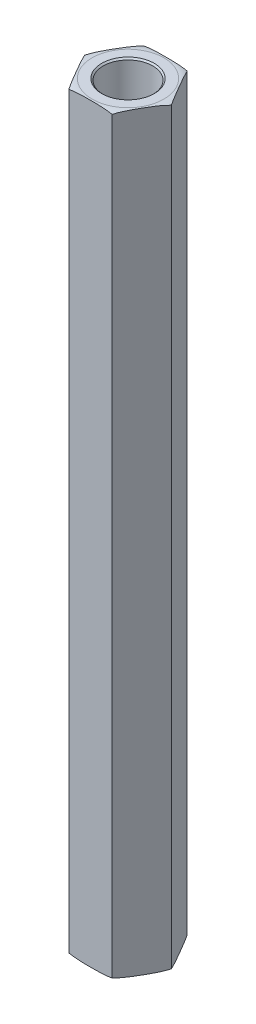
ISO-10303-21;
HEADER;
FILE_DESCRIPTION(('STEP AP214'),'2;1');
FILE_NAME('part.step','',(''),(''),'','','');
FILE_SCHEMA(('AUTOMOTIVE_DESIGN { 1 0 10303 214 1 1 1 1 }'));
ENDSEC;
DATA;
#1=APPLICATION_CONTEXT('core data for automotive mechanical design processes');
#2=APPLICATION_PROTOCOL_DEFINITION('international standard','automotive_design',2000,#1);
#3=PRODUCT_CONTEXT('',#1,'mechanical');
#4=PRODUCT('Part','Part','',(#3));
#5=PRODUCT_RELATED_PRODUCT_CATEGORY('part','',(#4));
#6=PRODUCT_DEFINITION_FORMATION('','',#4);
#7=PRODUCT_DEFINITION_CONTEXT('part definition',#1,'design');
#8=PRODUCT_DEFINITION('design','',#6,#7);
#9=PRODUCT_DEFINITION_SHAPE('','',#8);
#10=(LENGTH_UNIT() NAMED_UNIT(*) SI_UNIT(.MILLI.,.METRE.));
#11=(NAMED_UNIT(*) PLANE_ANGLE_UNIT() SI_UNIT($,.RADIAN.));
#12=(NAMED_UNIT(*) SI_UNIT($,.STERADIAN.) SOLID_ANGLE_UNIT());
#13=UNCERTAINTY_MEASURE_WITH_UNIT(LENGTH_MEASURE(1.E-05),#10,'distance_accuracy_value','');
#14=(GEOMETRIC_REPRESENTATION_CONTEXT(3) GLOBAL_UNCERTAINTY_ASSIGNED_CONTEXT((#13)) GLOBAL_UNIT_ASSIGNED_CONTEXT((#10,
#11,#12)) REPRESENTATION_CONTEXT('',''));
#15=CARTESIAN_POINT('',(0.,0.,0.));
#16=DIRECTION('',(0.,0.,1.));
#17=DIRECTION('',(1.,0.,0.));
#18=AXIS2_PLACEMENT_3D('',#15,#16,#17);
#19=CARTESIAN_POINT('',(0.,19.05,0.));
#20=DIRECTION('',(0.,1.,0.));
#21=DIRECTION('',(0.,0.,1.));
#22=AXIS2_PLACEMENT_3D('',#19,#20,#21);
#23=PLANE('',#22);
#24=CARTESIAN_POINT('',(0.,19.05,0.));
#25=DIRECTION('',(0.,1.,0.));
#26=DIRECTION('',(0.,0.,1.));
#27=AXIS2_PLACEMENT_3D('',#24,#25,#26);
#28=CIRCLE('',#27,2.0955);
#29=CARTESIAN_POINT('',(0.,19.05,2.0955));
#30=VERTEX_POINT('',#29);
#31=EDGE_CURVE('E303',#30,#30,#28,.T.);
#32=ORIENTED_EDGE('',*,*,#31,.T.);
#33=EDGE_LOOP('',(#32));
#34=FACE_BOUND('',#33,.T.);
#35=ADVANCED_FACE('F17',(#34),#23,.T.);
#36=CARTESIAN_POINT('',(0.,-19.05,0.));
#37=DIRECTION('',(0.,-1.,0.));
#38=DIRECTION('',(0.,0.,-1.));
#39=AXIS2_PLACEMENT_3D('',#36,#37,#38);
#40=PLANE('',#39);
#41=CARTESIAN_POINT('',(0.,-19.05,0.));
#42=DIRECTION('',(0.,-1.,0.));
#43=DIRECTION('',(0.,0.,-1.));
#44=AXIS2_PLACEMENT_3D('',#41,#42,#43);
#45=CIRCLE('',#44,2.0955);
#46=CARTESIAN_POINT('',(0.,-19.05,-2.0955));
#47=VERTEX_POINT('',#46);
#48=EDGE_CURVE('E313',#47,#47,#45,.T.);
#49=ORIENTED_EDGE('',*,*,#48,.T.);
#50=EDGE_LOOP('',(#49));
#51=FACE_BOUND('',#50,.T.);
#52=ADVANCED_FACE('F414',(#51),#40,.T.);
#53=CARTESIAN_POINT('',(0.,19.05,0.));
#54=DIRECTION('',(0.,1.,0.));
#55=DIRECTION('',(0.,0.,1.));
#56=AXIS2_PLACEMENT_3D('',#53,#54,#55);
#57=CYLINDRICAL_SURFACE('',#56,2.0955);
#58=CARTESIAN_POINT('',(0.,31.6230000000246,0.));
#59=DIRECTION('',(0.,1.,0.));
#60=DIRECTION('',(0.,0.,1.));
#61=AXIS2_PLACEMENT_3D('',#58,#59,#60);
#62=CIRCLE('',#61,2.09549999993897);
#63=CARTESIAN_POINT('',(0.,31.6230000000246,2.09549999993897));
#64=VERTEX_POINT('',#63);
#65=EDGE_CURVE('E315',#64,#64,#62,.T.);
#66=ORIENTED_EDGE('',*,*,#65,.T.);
#67=EDGE_LOOP('',(#66));
#68=FACE_BOUND('',#67,.T.);
#69=ORIENTED_EDGE('',*,*,#31,.F.);
#70=EDGE_LOOP('',(#69));
#71=FACE_BOUND('',#70,.T.);
#72=ADVANCED_FACE('F325',(#68,#71),#57,.F.);
#73=CARTESIAN_POINT('',(0.,-19.05,0.));
#74=DIRECTION('',(0.,-1.,0.));
#75=DIRECTION('',(0.,0.,-1.));
#76=AXIS2_PLACEMENT_3D('',#73,#74,#75);
#77=CYLINDRICAL_SURFACE('',#76,2.0955);
#78=ORIENTED_EDGE('',*,*,#48,.F.);
#79=EDGE_LOOP('',(#78));
#80=FACE_BOUND('',#79,.T.);
#81=CARTESIAN_POINT('',(0.,-31.6229999999678,0.));
#82=DIRECTION('',(0.,-1.,0.));
#83=DIRECTION('',(0.,0.,-1.));
#84=AXIS2_PLACEMENT_3D('',#81,#82,#83);
#85=CIRCLE('',#84,2.09549999999581);
#86=CARTESIAN_POINT('',(0.,-31.6229999999678,-2.09549999999581));
#87=VERTEX_POINT('',#86);
#88=EDGE_CURVE('E155',#87,#87,#85,.T.);
#89=ORIENTED_EDGE('',*,*,#88,.T.);
#90=EDGE_LOOP('',(#89));
#91=FACE_BOUND('',#90,.T.);
#92=ADVANCED_FACE('F330',(#80,#91),#77,.F.);
#93=CARTESIAN_POINT('',(0.,31.7499999999313,0.));
#94=DIRECTION('',(0.,1.,0.));
#95=DIRECTION('',(0.,0.,1.));
#96=AXIS2_PLACEMENT_3D('',#93,#94,#95);
#97=CONICAL_SURFACE('',#96,2.2224999998457,0.785398163173655);
#98=CARTESIAN_POINT('',(0.,31.7499999999882,0.));
#99=DIRECTION('',(0.,1.,0.));
#100=DIRECTION('',(0.,0.,1.));
#101=AXIS2_PLACEMENT_3D('',#98,#99,#100);
#102=CIRCLE('',#101,2.22249999990254);
#103=CARTESIAN_POINT('',(0.,31.7499999999882,2.22249999990254));
#104=VERTEX_POINT('',#103);
#105=EDGE_CURVE('E80',#104,#104,#102,.T.);
#106=ORIENTED_EDGE('',*,*,#105,.T.);
#107=EDGE_LOOP('',(#106));
#108=FACE_BOUND('',#107,.T.);
#109=ORIENTED_EDGE('',*,*,#65,.F.);
#110=EDGE_LOOP('',(#109));
#111=FACE_BOUND('',#110,.T.);
#112=ADVANCED_FACE('F328',(#108,#111),#97,.F.);
#113=CARTESIAN_POINT('',(-3.66617420935413,31.75,0.));
#114=DIRECTION('',(0.866025403784439,0.,-0.499999999999999));
#115=DIRECTION('',(-0.499999999999999,0.,-0.866025403784439));
#116=AXIS2_PLACEMENT_3D('',#113,#114,#115);
#117=PLANE('',#116);
#118=DIRECTION('',(0.,1.,0.));
#119=VECTOR('',#118,1.);
#120=CARTESIAN_POINT('',(-1.83308710467708,31.75,3.175));
#121=LINE('',#120,#119);
#122=CARTESIAN_POINT('',(-1.83308710467708,-31.623,3.17499999999999));
#123=VERTEX_POINT('',#122);
#124=CARTESIAN_POINT('',(-1.83308710467706,31.623,3.175));
#125=VERTEX_POINT('',#124);
#126=EDGE_CURVE('E76',#123,#125,#121,.T.);
#127=ORIENTED_EDGE('',*,*,#126,.T.);
#128=CARTESIAN_POINT('',(-3.66617420935412,31.623,0.));
#129=CARTESIAN_POINT('',(-3.62797961467395,31.6389014148997,0.0661549785605663));
#130=CARTESIAN_POINT('',(-3.58956810864157,31.6524886076105,0.132685658603884));
#131=CARTESIAN_POINT('',(-3.51249051795711,31.6758161979402,0.266187961794369));
#132=CARTESIAN_POINT('',(-3.47382473049846,31.6855604771397,0.333159070187402));
#133=CARTESIAN_POINT('',(-3.39641631867873,31.7019966530451,0.467234372392395));
#134=CARTESIAN_POINT('',(-3.35767399633312,31.7086945328669,0.534338043098199));
#135=CARTESIAN_POINT('',(-3.28009834620113,31.7197767572932,0.668703010556999));
#136=CARTESIAN_POINT('',(-3.24126499587771,31.724160450474,0.735964346345286));
#137=CARTESIAN_POINT('',(-3.16354065964314,31.7312403004263,0.870586845688118));
#138=CARTESIAN_POINT('',(-3.12464965374475,31.7339355237591,0.93794804386159));
#139=CARTESIAN_POINT('',(-3.04685144594592,31.7381531983713,1.07269849250697));
#140=CARTESIAN_POINT('',(-3.00794424351969,31.7396756080272,1.14008774388958));
#141=CARTESIAN_POINT('',(-2.93051517598872,31.741922705889,1.27419882283589));
#142=CARTESIAN_POINT('',(-2.89199336248934,31.7426552468181,1.34092056101652));
#143=CARTESIAN_POINT('',(-2.81494778346143,31.7435767302574,1.47436741839142));
#144=CARTESIAN_POINT('',(-2.77642401791438,31.7437656658949,1.54109253761777));
#145=CARTESIAN_POINT('',(-2.69935964431011,31.7436659966806,1.67457194815384));
#146=CARTESIAN_POINT('',(-2.6608190363182,31.7433771811766,1.74132623935042));
#147=CARTESIAN_POINT('',(-2.58373908085328,31.742221986219,1.87483263846081));
#148=CARTESIAN_POINT('',(-2.54519973341244,31.7413555970386,1.9415847463189));
#149=CARTESIAN_POINT('',(-2.46812969629769,31.7387861940656,2.07507396634286));
#150=CARTESIAN_POINT('',(-2.42959900625964,31.7370832271616,2.14181107913946));
#151=CARTESIAN_POINT('',(-2.35255651340907,31.7324387229726,2.27525259109841));
#152=CARTESIAN_POINT('',(-2.31404470975441,31.7294972471358,2.34195699171939));
#153=CARTESIAN_POINT('',(-2.25084206239943,31.7232174124749,2.45142718811108));
#154=CARTESIAN_POINT('',(-2.22613849337009,31.7203980110463,2.49421502479819));
#155=CARTESIAN_POINT('',(-2.17676945272227,31.7138696794304,2.57972471152114));
#156=CARTESIAN_POINT('',(-2.15210397034182,31.7101610809139,2.62244658019726));
#157=CARTESIAN_POINT('',(-2.10282753811695,31.7016802711497,2.70779586442647));
#158=CARTESIAN_POINT('',(-2.07821657107528,31.6969084657008,2.75042330976604));
#159=CARTESIAN_POINT('',(-2.02900094683549,31.6860987712516,2.83566727147558));
#160=CARTESIAN_POINT('',(-2.00439646085463,31.6800577313084,2.87828349128855));
#161=CARTESIAN_POINT('',(-1.95527325900933,31.6665138354161,2.96336737271506));
#162=CARTESIAN_POINT('',(-1.93075459617614,31.659010197803,3.0058349424758));
#163=CARTESIAN_POINT('',(-1.88182157373172,31.6423203507084,3.09058942351745));
#164=CARTESIAN_POINT('',(-1.8574074405327,31.6331314978033,3.1328759426409));
#165=CARTESIAN_POINT('',(-1.83308710467707,31.623,3.175));
#166=B_SPLINE_CURVE_WITH_KNOTS('',3,(#128,#129,#130,#131,#132,#133,#134,#135,#136,#137,#138,
#139,#140,#141,#142,#143,#144,#145,#146,#147,#148,#149,#150,#151,#152,#153,#154,#155,#156,#157,
#158,#159,#160,#161,#162,#163,#164,#165),.UNSPECIFIED.,.F.,.F.,(4,2,2,2,2,2,2,2,2,2,2,2,2,2,2,2,
2,2,4),(0.,0.233977307817944,0.467717675040698,0.700996973557508,0.93434190322976,
1.16781571967241,1.40129782179826,1.63243665809671,1.86357841666619,2.09482211846296,
2.32606971471497,2.557304351474,2.78852751694416,2.93698369265089,3.08538458004475,
3.23372892334585,3.38244598546613,3.53124274626084,3.68027493713584),.UNSPECIFIED.);
#167=CARTESIAN_POINT('',(-3.66617420935412,31.623,0.));
#168=VERTEX_POINT('',#167);
#169=EDGE_CURVE('E69',#168,#125,#166,.T.);
#170=ORIENTED_EDGE('',*,*,#169,.F.);
#171=DIRECTION('',(0.,1.,0.));
#172=VECTOR('',#171,1.);
#173=CARTESIAN_POINT('',(-3.66617420935413,31.75,0.));
#174=LINE('',#173,#172);
#175=CARTESIAN_POINT('',(-3.66617420935412,-31.623,0.));
#176=VERTEX_POINT('',#175);
#177=EDGE_CURVE('E73',#168,#176,#174,.F.);
#178=ORIENTED_EDGE('',*,*,#177,.T.);
#179=CARTESIAN_POINT('',(-1.83308710467708,-31.623,3.17499999999999));
#180=CARTESIAN_POINT('',(-1.87128169935725,-31.6389014148997,3.10884502143943));
#181=CARTESIAN_POINT('',(-1.90969320538963,-31.6524886076105,3.04231434139611));
#182=CARTESIAN_POINT('',(-1.98677079607409,-31.6758161979402,2.90881203820563));
#183=CARTESIAN_POINT('',(-2.02543658353273,-31.6855604771397,2.84184092981259));
#184=CARTESIAN_POINT('',(-2.10284499535247,-31.7019966530451,2.7077656276076));
#185=CARTESIAN_POINT('',(-2.14158731769807,-31.7086945328669,2.6406619569018));
#186=CARTESIAN_POINT('',(-2.21916296783006,-31.7197767572932,2.506296989443));
#187=CARTESIAN_POINT('',(-2.25799631815349,-31.724160450474,2.43903565365471));
#188=CARTESIAN_POINT('',(-2.33572065438805,-31.7312403004263,2.30441315431188));
#189=CARTESIAN_POINT('',(-2.37461166028644,-31.7339355237591,2.23705195613841));
#190=CARTESIAN_POINT('',(-2.45240986808527,-31.7381531983713,2.10230150749303));
#191=CARTESIAN_POINT('',(-2.49131707051151,-31.7396756080272,2.03491225611042));
#192=CARTESIAN_POINT('',(-2.56874613804247,-31.741922705889,1.90080117716411));
#193=CARTESIAN_POINT('',(-2.60726795154186,-31.7426552468181,1.83407943898348));
#194=CARTESIAN_POINT('',(-2.68431353056977,-31.7435767302574,1.70063258160857));
#195=CARTESIAN_POINT('',(-2.72283729611681,-31.7437656658949,1.63390746238222));
#196=CARTESIAN_POINT('',(-2.79990166972108,-31.7436659966806,1.50042805184616));
#197=CARTESIAN_POINT('',(-2.83844227771299,-31.7433771811766,1.43367376064957));
#198=CARTESIAN_POINT('',(-2.91552223317791,-31.742221986219,1.30016736153919));
#199=CARTESIAN_POINT('',(-2.95406158061876,-31.7413555970386,1.2334152536811));
#200=CARTESIAN_POINT('',(-3.0311316177335,-31.7387861940656,1.09992603365714));
#201=CARTESIAN_POINT('',(-3.06966230777156,-31.7370832271617,1.03318892086053));
#202=CARTESIAN_POINT('',(-3.14670480062212,-31.7324387229726,0.899747408901591));
#203=CARTESIAN_POINT('',(-3.18521660427678,-31.7294972471358,0.833043008280606));
#204=CARTESIAN_POINT('',(-3.24841925163176,-31.7232174124749,0.723572811888923));
#205=CARTESIAN_POINT('',(-3.27312282066111,-31.7203980110463,0.68078497520181));
#206=CARTESIAN_POINT('',(-3.32249186130892,-31.7138696794304,0.595275288478855));
#207=CARTESIAN_POINT('',(-3.34715734368937,-31.7101610809139,0.552553419802734));
#208=CARTESIAN_POINT('',(-3.39643377591424,-31.7016802711497,0.46720413557353));
#209=CARTESIAN_POINT('',(-3.42104474295591,-31.6969084657008,0.424576690233957));
#210=CARTESIAN_POINT('',(-3.4702603671957,-31.6860987712516,0.339332728524421));
#211=CARTESIAN_POINT('',(-3.49486485317656,-31.6800577313084,0.296716508711453));
#212=CARTESIAN_POINT('',(-3.54398805502186,-31.6665138354161,0.211632627284938));
#213=CARTESIAN_POINT('',(-3.56850671785505,-31.659010197803,0.169165057524199));
#214=CARTESIAN_POINT('',(-3.61743974029947,-31.6423203507084,0.0844105764825454));
#215=CARTESIAN_POINT('',(-3.64185387349849,-31.6331314978033,0.0421240573590993));
#216=CARTESIAN_POINT('',(-3.66617420935412,-31.623,0.));
#217=B_SPLINE_CURVE_WITH_KNOTS('',3,(#179,#180,#181,#182,#183,#184,#185,#186,#187,#188,#189,
#190,#191,#192,#193,#194,#195,#196,#197,#198,#199,#200,#201,#202,#203,#204,#205,#206,#207,#208,
#209,#210,#211,#212,#213,#214,#215,#216),.UNSPECIFIED.,.F.,.F.,(4,2,2,2,2,2,2,2,2,2,2,2,2,2,2,2,
2,2,4),(0.,0.233977307817944,0.467717675040698,0.700996973557507,0.934341903229758,
1.16781571967241,1.40129782179826,1.63243665809671,1.86357841666619,2.09482211846296,
2.32606971471497,2.557304351474,2.78852751694415,2.93698369265089,3.08538458004475,
3.23372892334585,3.38244598546612,3.53124274626083,3.68027493713583),.UNSPECIFIED.);
#218=EDGE_CURVE('E88',#123,#176,#217,.T.);
#219=ORIENTED_EDGE('',*,*,#218,.F.);
#220=EDGE_LOOP('',(#127,#170,#178,#219));
#221=FACE_BOUND('',#220,.T.);
#222=ADVANCED_FACE('F71',(#221),#117,.F.);
#223=CARTESIAN_POINT('',(0.,-31.7499999998745,0.));
#224=DIRECTION('',(0.,-1.,0.));
#225=DIRECTION('',(0.,0.,-1.));
#226=AXIS2_PLACEMENT_3D('',#223,#224,#225);
#227=CONICAL_SURFACE('',#226,2.22249999990254,0.785398163397448);
#228=ORIENTED_EDGE('',*,*,#88,.F.);
#229=EDGE_LOOP('',(#228));
#230=FACE_BOUND('',#229,.T.);
#231=CARTESIAN_POINT('',(0.,-31.7499999999882,0.));
#232=DIRECTION('',(0.,-1.,0.));
#233=DIRECTION('',(0.,0.,-1.));
#234=AXIS2_PLACEMENT_3D('',#231,#232,#233);
#235=CIRCLE('',#234,2.22250000001623);
#236=CARTESIAN_POINT('',(0.,-31.7499999999882,-2.22250000001623));
#237=VERTEX_POINT('',#236);
#238=EDGE_CURVE('E279',#237,#237,#235,.F.);
#239=ORIENTED_EDGE('',*,*,#238,.F.);
#240=EDGE_LOOP('',(#239));
#241=FACE_BOUND('',#240,.T.);
#242=ADVANCED_FACE('F337',(#230,#241),#227,.F.);
#243=CARTESIAN_POINT('',(-1.83308710467707,31.75,-3.175));
#244=DIRECTION('',(0.,-1.,0.));
#245=DIRECTION('',(0.,0.,-1.));
#246=AXIS2_PLACEMENT_3D('',#243,#244,#245);
#247=PLANE('',#246);
#248=CARTESIAN_POINT('',(0.,31.75,0.));
#249=DIRECTION('',(0.,-1.,0.));
#250=DIRECTION('',(0.,0.,1.));
#251=AXIS2_PLACEMENT_3D('',#248,#249,#250);
#252=CIRCLE('',#251,3.03117420935412);
#253=CARTESIAN_POINT('',(0.,31.75,3.03117420935412));
#254=VERTEX_POINT('',#253);
#255=CARTESIAN_POINT('',(0.,31.75,-3.03117420935412));
#256=VERTEX_POINT('',#255);
#257=EDGE_CURVE('E79',#254,#256,#252,.T.);
#258=ORIENTED_EDGE('',*,*,#257,.F.);
#259=CARTESIAN_POINT('',(0.,31.75,0.));
#260=DIRECTION('',(0.,-1.,0.));
#261=DIRECTION('',(0.,0.,-1.));
#262=AXIS2_PLACEMENT_3D('',#259,#260,#261);
#263=CIRCLE('',#262,3.03117420935412);
#264=EDGE_CURVE('E140',#256,#254,#263,.T.);
#265=ORIENTED_EDGE('',*,*,#264,.F.);
#266=EDGE_LOOP('',(#258,#265));
#267=FACE_BOUND('',#266,.T.);
#268=ORIENTED_EDGE('',*,*,#105,.F.);
#269=EDGE_LOOP('',(#268));
#270=FACE_BOUND('',#269,.T.);
#271=ADVANCED_FACE('F116',(#267,#270),#247,.F.);
#272=CARTESIAN_POINT('',(-1.83308710467707,31.75,-3.175));
#273=DIRECTION('',(0.866025403784439,0.,0.5));
#274=DIRECTION('',(0.5,0.,-0.866025403784439));
#275=AXIS2_PLACEMENT_3D('',#272,#273,#274);
#276=PLANE('',#275);
#277=ORIENTED_EDGE('',*,*,#177,.F.);
#278=CARTESIAN_POINT('',(-1.83308710467706,31.623,-3.17500000000001));
#279=CARTESIAN_POINT('',(-1.87128169935723,31.6389014148997,-3.10884502143945));
#280=CARTESIAN_POINT('',(-1.90969320538961,31.6524886076105,-3.04231434139614));
#281=CARTESIAN_POINT('',(-1.98677079607407,31.6758161979402,-2.90881203820566));
#282=CARTESIAN_POINT('',(-2.02543658353271,31.6855604771397,-2.84184092981263));
#283=CARTESIAN_POINT('',(-2.10284499535244,31.7019966530451,-2.70776562760764));
#284=CARTESIAN_POINT('',(-2.14158731769805,31.7086945328669,-2.64066195690184));
#285=CARTESIAN_POINT('',(-2.21916296783004,31.7197767572932,-2.50629698944304));
#286=CARTESIAN_POINT('',(-2.25799631815346,31.7241604504739,-2.43903565365476));
#287=CARTESIAN_POINT('',(-2.33572065438802,31.7312403004263,-2.30441315431193));
#288=CARTESIAN_POINT('',(-2.37461166028641,31.7339355237591,-2.23705195613846));
#289=CARTESIAN_POINT('',(-2.45240986808524,31.7381531983713,-2.10230150749309));
#290=CARTESIAN_POINT('',(-2.49131707051148,31.7396756080272,-2.03491225611048));
#291=CARTESIAN_POINT('',(-2.56874613804244,31.741922705889,-1.90080117716417));
#292=CARTESIAN_POINT('',(-2.60726795154182,31.7426552468181,-1.83407943898354));
#293=CARTESIAN_POINT('',(-2.68431353056973,31.7435767302574,-1.70063258160864));
#294=CARTESIAN_POINT('',(-2.72283729611677,31.7437656658949,-1.6339074623823));
#295=CARTESIAN_POINT('',(-2.79990166972104,31.7436659966806,-1.50042805184624));
#296=CARTESIAN_POINT('',(-2.83844227771295,31.7433771811766,-1.43367376064965));
#297=CARTESIAN_POINT('',(-2.91552223317786,31.742221986219,-1.30016736153927));
#298=CARTESIAN_POINT('',(-2.95406158061871,31.7413555970386,-1.23341525368118));
#299=CARTESIAN_POINT('',(-3.03113161773345,31.7387861940656,-1.09992603365722));
#300=CARTESIAN_POINT('',(-3.06966230777151,31.7370832271617,-1.03318892086062));
#301=CARTESIAN_POINT('',(-3.14670480062207,31.7324387229726,-0.899747408901685));
#302=CARTESIAN_POINT('',(-3.18521660427673,31.7294972471358,-0.833043008280701));
#303=CARTESIAN_POINT('',(-3.24841925163171,31.7232174124749,-0.723572811889015));
#304=CARTESIAN_POINT('',(-3.27312282066106,31.7203980110463,-0.680784975201897));
#305=CARTESIAN_POINT('',(-3.32249186130888,31.7138696794304,-0.595275288478931));
#306=CARTESIAN_POINT('',(-3.34715734368933,31.7101610809139,-0.552553419802804));
#307=CARTESIAN_POINT('',(-3.39643377591421,31.7016802711497,-0.467204135573589));
#308=CARTESIAN_POINT('',(-3.42104474295588,31.6969084657008,-0.424576690234012));
#309=CARTESIAN_POINT('',(-3.47026036719568,31.6860987712516,-0.339332728524465));
#310=CARTESIAN_POINT('',(-3.49486485317654,31.6800577313084,-0.296716508711491));
#311=CARTESIAN_POINT('',(-3.54398805502185,31.6665138354161,-0.211632627284964));
#312=CARTESIAN_POINT('',(-3.56850671785504,31.659010197803,-0.169165057524221));
#313=CARTESIAN_POINT('',(-3.61743974029947,31.6423203507084,-0.0844105764825552));
#314=CARTESIAN_POINT('',(-3.64185387349849,31.6331314978033,-0.0421240573591034));
#315=CARTESIAN_POINT('',(-3.66617420935413,31.623,0.));
#316=B_SPLINE_CURVE_WITH_KNOTS('',3,(#278,#279,#280,#281,#282,#283,#284,#285,#286,#287,#288,
#289,#290,#291,#292,#293,#294,#295,#296,#297,#298,#299,#300,#301,#302,#303,#304,#305,#306,#307,
#308,#309,#310,#311,#312,#313,#314,#315),.UNSPECIFIED.,.F.,.F.,(4,2,2,2,2,2,2,2,2,2,2,2,2,2,2,2,
2,2,4),(0.,0.233977307817937,0.467717675040683,0.700996973557484,0.934341903229729,
1.16781571967237,1.40129782179821,1.63243665809666,1.86357841666613,2.0948221184629,
2.3260697147149,2.55730435147392,2.78852751694407,2.93698369265082,3.0853845800447,
3.23372892334582,3.38244598546612,3.53124274626084,3.68027493713587),.UNSPECIFIED.);
#317=CARTESIAN_POINT('',(-1.83308710467705,31.623,-3.17500000000001));
#318=VERTEX_POINT('',#317);
#319=EDGE_CURVE('E85',#318,#168,#316,.T.);
#320=ORIENTED_EDGE('',*,*,#319,.F.);
#321=DIRECTION('',(0.,1.,0.));
#322=VECTOR('',#321,1.);
#323=CARTESIAN_POINT('',(-1.83308710467704,31.75,-3.175));
#324=LINE('',#323,#322);
#325=CARTESIAN_POINT('',(-1.83308710467708,-31.623,-3.175));
#326=VERTEX_POINT('',#325);
#327=EDGE_CURVE('E178',#318,#326,#324,.F.);
#328=ORIENTED_EDGE('',*,*,#327,.T.);
#329=CARTESIAN_POINT('',(-3.66617420935412,-31.623,0.));
#330=CARTESIAN_POINT('',(-3.62797961467395,-31.6389014148997,-0.0661549785605667));
#331=CARTESIAN_POINT('',(-3.58956810864157,-31.6524886076105,-0.132685658603884));
#332=CARTESIAN_POINT('',(-3.51249051795711,-31.6758161979402,-0.266187961794367));
#333=CARTESIAN_POINT('',(-3.47382473049847,-31.6855604771397,-0.333159070187399));
#334=CARTESIAN_POINT('',(-3.39641631867874,-31.7019966530451,-0.467234372392391));
#335=CARTESIAN_POINT('',(-3.35767399633313,-31.7086945328669,-0.534338043098195));
#336=CARTESIAN_POINT('',(-3.28009834620114,-31.7197767572932,-0.668703010556993));
#337=CARTESIAN_POINT('',(-3.24126499587771,-31.724160450474,-0.73596434634528));
#338=CARTESIAN_POINT('',(-3.16354065964315,-31.7312403004263,-0.870586845688111));
#339=CARTESIAN_POINT('',(-3.12464965374476,-31.7339355237591,-0.937948043861582));
#340=CARTESIAN_POINT('',(-3.04685144594593,-31.7381531983713,-1.07269849250696));
#341=CARTESIAN_POINT('',(-3.00794424351969,-31.7396756080272,-1.14008774388957));
#342=CARTESIAN_POINT('',(-2.93051517598873,-31.741922705889,-1.27419882283587));
#343=CARTESIAN_POINT('',(-2.89199336248934,-31.7426552468181,-1.34092056101651));
#344=CARTESIAN_POINT('',(-2.81494778346144,-31.7435767302574,-1.47436741839141));
#345=CARTESIAN_POINT('',(-2.77642401791439,-31.7437656658949,-1.54109253761776));
#346=CARTESIAN_POINT('',(-2.69935964431012,-31.7436659966806,-1.67457194815382));
#347=CARTESIAN_POINT('',(-2.66081903631821,-31.7433771811766,-1.74132623935041));
#348=CARTESIAN_POINT('',(-2.5837390808533,-31.742221986219,-1.87483263846079));
#349=CARTESIAN_POINT('',(-2.54519973341245,-31.7413555970386,-1.94158474631888));
#350=CARTESIAN_POINT('',(-2.4681296962977,-31.7387861940656,-2.07507396634284));
#351=CARTESIAN_POINT('',(-2.42959900625965,-31.7370832271617,-2.14181107913944));
#352=CARTESIAN_POINT('',(-2.35255651340908,-31.7324387229726,-2.27525259109839));
#353=CARTESIAN_POINT('',(-2.31404470975442,-31.7294972471358,-2.34195699171937));
#354=CARTESIAN_POINT('',(-2.25084206239944,-31.7232174124749,-2.45142718811105));
#355=CARTESIAN_POINT('',(-2.2261384933701,-31.7203980110463,-2.49421502479817));
#356=CARTESIAN_POINT('',(-2.17676945272228,-31.7138696794304,-2.57972471152112));
#357=CARTESIAN_POINT('',(-2.15210397034184,-31.7101610809139,-2.62244658019725));
#358=CARTESIAN_POINT('',(-2.10282753811696,-31.7016802711497,-2.70779586442645));
#359=CARTESIAN_POINT('',(-2.07821657107529,-31.6969084657008,-2.75042330976602));
#360=CARTESIAN_POINT('',(-2.0290009468355,-31.6860987712516,-2.83566727147556));
#361=CARTESIAN_POINT('',(-2.00439646085464,-31.6800577313084,-2.87828349128853));
#362=CARTESIAN_POINT('',(-1.95527325900934,-31.6665138354161,-2.96336737271505));
#363=CARTESIAN_POINT('',(-1.93075459617615,-31.659010197803,-3.00583494247579));
#364=CARTESIAN_POINT('',(-1.88182157373172,-31.6423203507084,-3.09058942351744));
#365=CARTESIAN_POINT('',(-1.85740744053271,-31.6331314978033,-3.13287594264089));
#366=CARTESIAN_POINT('',(-1.83308710467707,-31.623,-3.17499999999999));
#367=B_SPLINE_CURVE_WITH_KNOTS('',3,(#329,#330,#331,#332,#333,#334,#335,#336,#337,#338,#339,
#340,#341,#342,#343,#344,#345,#346,#347,#348,#349,#350,#351,#352,#353,#354,#355,#356,#357,#358,
#359,#360,#361,#362,#363,#364,#365,#366),.UNSPECIFIED.,.F.,.F.,(4,2,2,2,2,2,2,2,2,2,2,2,2,2,2,2,
2,2,4),(0.,0.233977307817942,0.467717675040695,0.700996973557501,0.934341903229752,
1.1678157196724,1.40129782179825,1.6324366580967,1.86357841666617,2.09482211846295,
2.32606971471495,2.55730435147398,2.78852751694413,2.93698369265087,3.08538458004473,
3.23372892334584,3.38244598546612,3.53124274626082,3.68027493713583),.UNSPECIFIED.);
#368=EDGE_CURVE('E87',#176,#326,#367,.T.);
#369=ORIENTED_EDGE('',*,*,#368,.F.);
#370=EDGE_LOOP('',(#277,#320,#328,#369));
#371=FACE_BOUND('',#370,.T.);
#372=ADVANCED_FACE('F83',(#371),#276,.F.);
#373=CARTESIAN_POINT('',(-1.83308710467707,31.75,3.175));
#374=DIRECTION('',(0.,0.,-1.));
#375=DIRECTION('',(-1.,0.,0.));
#376=AXIS2_PLACEMENT_3D('',#373,#374,#375);
#377=PLANE('',#376);
#378=DIRECTION('',(0.,1.,0.));
#379=VECTOR('',#378,1.);
#380=CARTESIAN_POINT('',(1.83308710467706,31.75,3.17499999999999));
#381=LINE('',#380,#379);
#382=CARTESIAN_POINT('',(1.83308710467706,-31.623,3.17499999999999));
#383=VERTEX_POINT('',#382);
#384=CARTESIAN_POINT('',(1.83308710467706,31.623,3.17499999999999));
#385=VERTEX_POINT('',#384);
#386=EDGE_CURVE('E180',#383,#385,#381,.T.);
#387=ORIENTED_EDGE('',*,*,#386,.T.);
#388=CARTESIAN_POINT('',(-1.83308710467706,31.623,3.175));
#389=CARTESIAN_POINT('',(-1.73237579828683,31.6439400141518,3.175));
#390=CARTESIAN_POINT('',(-1.63096506893486,31.6608853495327,3.175));
#391=CARTESIAN_POINT('',(-1.42767146651469,31.6884971643984,3.175));
#392=CARTESIAN_POINT('',(-1.32579191427254,31.6991875658753,3.175));
#393=CARTESIAN_POINT('',(-1.12177634709138,31.7161280408079,3.175));
#394=CARTESIAN_POINT('',(-1.0196405664338,31.7223812707189,3.175));
#395=CARTESIAN_POINT('',(-0.815663681397377,31.7319028064183,3.175));
#396=CARTESIAN_POINT('',(-0.713823115514574,31.7351834044999,3.175));
#397=CARTESIAN_POINT('',(-0.510018485441651,31.7399454848703,3.175));
#398=CARTESIAN_POINT('',(-0.408054390577977,31.7414254100882,3.175));
#399=CARTESIAN_POINT('',(-0.204060200337871,31.7433146818379,3.175));
#400=CARTESIAN_POINT('',(-0.102030100168935,31.7437234241492,3.17499999999999));
#401=CARTESIAN_POINT('',(0.102030100168936,31.7437234241492,3.17499999999999));
#402=CARTESIAN_POINT('',(0.204060200337871,31.7433146818379,3.17499999999999));
#403=CARTESIAN_POINT('',(0.408054390577978,31.7414254100882,3.175));
#404=CARTESIAN_POINT('',(0.510018485441653,31.7399454848703,3.17499999999999));
#405=CARTESIAN_POINT('',(0.713823115514575,31.7351834044999,3.17499999999999));
#406=CARTESIAN_POINT('',(0.815663681397378,31.7319028064183,3.17499999999999));
#407=CARTESIAN_POINT('',(1.0196405664338,31.7223812707189,3.17499999999999));
#408=CARTESIAN_POINT('',(1.12177634709138,31.7161280408079,3.17499999999999));
#409=CARTESIAN_POINT('',(1.32579191427254,31.6991875658753,3.17499999999999));
#410=CARTESIAN_POINT('',(1.42767146651469,31.6884971643984,3.17499999999999));
#411=CARTESIAN_POINT('',(1.63096506893486,31.6608853495327,3.17499999999999));
#412=CARTESIAN_POINT('',(1.73237579828684,31.6439400141518,3.17499999999999));
#413=CARTESIAN_POINT('',(1.83308710467706,31.623,3.17499999999999));
#414=B_SPLINE_CURVE_WITH_KNOTS('',3,(#388,#389,#390,#391,#392,#393,#394,#395,#396,#397,#398,
#399,#400,#401,#402,#403,#404,#405,#406,#407,#408,#409,#410,#411,#412,#413),.UNSPECIFIED.,.F.,
.F.,(4,2,2,2,2,2,2,2,2,2,2,2,4),(0.,0.308333242342808,0.615479423308236,0.92240689113001,
1.2280592962085,1.53397581645216,1.84006485747889,2.14615389850562,2.45207041874928,
2.75772282382777,3.06465029164955,3.37179647261497,3.68012971495778),.UNSPECIFIED.);
#415=EDGE_CURVE('E274',#125,#385,#414,.T.);
#416=ORIENTED_EDGE('',*,*,#415,.F.);
#417=ORIENTED_EDGE('',*,*,#126,.F.);
#418=CARTESIAN_POINT('',(1.83308710467706,-31.623,3.17499999999999));
#419=CARTESIAN_POINT('',(1.73237579828684,-31.6439400141518,3.17499999999999));
#420=CARTESIAN_POINT('',(1.63096506893486,-31.6608853495327,3.17499999999999));
#421=CARTESIAN_POINT('',(1.42767146651469,-31.6884971643984,3.17499999999999));
#422=CARTESIAN_POINT('',(1.32579191427254,-31.6991875658753,3.17499999999999));
#423=CARTESIAN_POINT('',(1.12177634709138,-31.7161280408079,3.17499999999999));
#424=CARTESIAN_POINT('',(1.0196405664338,-31.7223812707189,3.17499999999999));
#425=CARTESIAN_POINT('',(0.815663681397379,-31.7319028064183,3.17499999999999));
#426=CARTESIAN_POINT('',(0.713823115514576,-31.7351834044999,3.17499999999999));
#427=CARTESIAN_POINT('',(0.510018485441653,-31.7399454848703,3.17499999999999));
#428=CARTESIAN_POINT('',(0.408054390577978,-31.7414254100882,3.175));
#429=CARTESIAN_POINT('',(0.204060200337871,-31.7433146818379,3.17499999999999));
#430=CARTESIAN_POINT('',(0.102030100168936,-31.7437234241492,3.17499999999999));
#431=CARTESIAN_POINT('',(-0.102030100168936,-31.7437234241492,3.17499999999999));
#432=CARTESIAN_POINT('',(-0.204060200337873,-31.7433146818379,3.175));
#433=CARTESIAN_POINT('',(-0.408054390577981,-31.7414254100882,3.175));
#434=CARTESIAN_POINT('',(-0.510018485441656,-31.7399454848703,3.175));
#435=CARTESIAN_POINT('',(-0.71382311551458,-31.7351834044999,3.175));
#436=CARTESIAN_POINT('',(-0.815663681397384,-31.7319028064183,3.175));
#437=CARTESIAN_POINT('',(-1.01964056643381,-31.7223812707189,3.175));
#438=CARTESIAN_POINT('',(-1.12177634709139,-31.7161280408079,3.175));
#439=CARTESIAN_POINT('',(-1.32579191427255,-31.6991875658753,3.175));
#440=CARTESIAN_POINT('',(-1.4276714665147,-31.6884971643984,3.175));
#441=CARTESIAN_POINT('',(-1.63096506893487,-31.6608853495327,3.175));
#442=CARTESIAN_POINT('',(-1.73237579828685,-31.6439400141518,3.175));
#443=CARTESIAN_POINT('',(-1.83308710467708,-31.623,3.175));
#444=B_SPLINE_CURVE_WITH_KNOTS('',3,(#418,#419,#420,#421,#422,#423,#424,#425,#426,#427,#428,
#429,#430,#431,#432,#433,#434,#435,#436,#437,#438,#439,#440,#441,#442,#443),.UNSPECIFIED.,.F.,
.F.,(4,2,2,2,2,2,2,2,2,2,2,2,4),(0.,0.308333242342809,0.615479423308237,0.922406891130012,
1.2280592962085,1.53397581645216,1.84006485747889,2.14615389850562,2.45207041874929,
2.75772282382778,3.06465029164956,3.37179647261499,3.6801297149578),.UNSPECIFIED.);
#445=EDGE_CURVE('E251',#383,#123,#444,.T.);
#446=ORIENTED_EDGE('',*,*,#445,.F.);
#447=EDGE_LOOP('',(#387,#416,#417,#446));
#448=FACE_BOUND('',#447,.T.);
#449=ADVANCED_FACE('F204',(#448),#377,.F.);
#450=CARTESIAN_POINT('',(-1.83308710467707,-31.75,-3.175));
#451=DIRECTION('',(0.,-1.,0.));
#452=DIRECTION('',(0.,0.,-1.));
#453=AXIS2_PLACEMENT_3D('',#450,#451,#452);
#454=PLANE('',#453);
#455=CARTESIAN_POINT('',(0.,-31.75,0.));
#456=DIRECTION('',(0.,1.,0.));
#457=DIRECTION('',(0.,0.,1.));
#458=AXIS2_PLACEMENT_3D('',#455,#456,#457);
#459=CIRCLE('',#458,3.03117420935412);
#460=CARTESIAN_POINT('',(0.,-31.75,3.03117420935412));
#461=VERTEX_POINT('',#460);
#462=CARTESIAN_POINT('',(0.,-31.75,-3.03117420935412));
#463=VERTEX_POINT('',#462);
#464=EDGE_CURVE('E190',#461,#463,#459,.T.);
#465=ORIENTED_EDGE('',*,*,#464,.F.);
#466=CARTESIAN_POINT('',(0.,-31.75,0.));
#467=DIRECTION('',(0.,1.,0.));
#468=DIRECTION('',(0.,0.,-1.));
#469=AXIS2_PLACEMENT_3D('',#466,#467,#468);
#470=CIRCLE('',#469,3.03117420935412);
#471=EDGE_CURVE('E183',#461,#463,#470,.F.);
#472=ORIENTED_EDGE('',*,*,#471,.T.);
#473=EDGE_LOOP('',(#465,#472));
#474=FACE_BOUND('',#473,.T.);
#475=ORIENTED_EDGE('',*,*,#238,.T.);
#476=EDGE_LOOP('',(#475));
#477=FACE_BOUND('',#476,.T.);
#478=ADVANCED_FACE('F195',(#474,#477),#454,.T.);
#479=CARTESIAN_POINT('',(1.83308710467706,31.75,3.17499999999999));
#480=DIRECTION('',(-0.866025403784439,0.,-0.5));
#481=DIRECTION('',(-0.5,0.,0.866025403784439));
#482=AXIS2_PLACEMENT_3D('',#479,#480,#481);
#483=PLANE('',#482);
#484=DIRECTION('',(0.,1.,0.));
#485=VECTOR('',#484,1.);
#486=CARTESIAN_POINT('',(3.66617420935412,31.75,0.));
#487=LINE('',#486,#485);
#488=CARTESIAN_POINT('',(3.66617420935412,-31.623,0.));
#489=VERTEX_POINT('',#488);
#490=CARTESIAN_POINT('',(3.66617420935412,31.623,0.));
#491=VERTEX_POINT('',#490);
#492=EDGE_CURVE('E236',#489,#491,#487,.T.);
#493=ORIENTED_EDGE('',*,*,#492,.T.);
#494=CARTESIAN_POINT('',(1.83308710467706,31.623,3.17499999999999));
#495=CARTESIAN_POINT('',(1.87128169935724,31.6389014148997,3.10884502143943));
#496=CARTESIAN_POINT('',(1.90969320538961,31.6524886076105,3.04231434139612));
#497=CARTESIAN_POINT('',(1.98677079607408,31.6758161979402,2.90881203820563));
#498=CARTESIAN_POINT('',(2.02543658353272,31.6855604771397,2.8418409298126));
#499=CARTESIAN_POINT('',(2.10284499535245,31.7019966530451,2.70776562760761));
#500=CARTESIAN_POINT('',(2.14158731769806,31.7086945328669,2.6406619569018));
#501=CARTESIAN_POINT('',(2.21916296783005,31.7197767572932,2.506296989443));
#502=CARTESIAN_POINT('',(2.25799631815348,31.724160450474,2.43903565365472));
#503=CARTESIAN_POINT('',(2.33572065438804,31.7312403004263,2.30441315431189));
#504=CARTESIAN_POINT('',(2.37461166028643,31.7339355237591,2.23705195613841));
#505=CARTESIAN_POINT('',(2.45240986808526,31.7381531983713,2.10230150749304));
#506=CARTESIAN_POINT('',(2.4913170705115,31.7396756080272,2.03491225611043));
#507=CARTESIAN_POINT('',(2.56874613804246,31.741922705889,1.90080117716412));
#508=CARTESIAN_POINT('',(2.60726795154185,31.7426552468181,1.83407943898349));
#509=CARTESIAN_POINT('',(2.68431353056976,31.7435767302574,1.70063258160858));
#510=CARTESIAN_POINT('',(2.7228372961168,31.7437656658949,1.63390746238223));
#511=CARTESIAN_POINT('',(2.79990166972107,31.7436659966806,1.50042805184617));
#512=CARTESIAN_POINT('',(2.83844227771298,31.7433771811766,1.43367376064958));
#513=CARTESIAN_POINT('',(2.9155222331779,31.742221986219,1.3001673615392));
#514=CARTESIAN_POINT('',(2.95406158061874,31.7413555970386,1.23341525368111));
#515=CARTESIAN_POINT('',(3.03113161773349,31.7387861940656,1.09992603365715));
#516=CARTESIAN_POINT('',(3.06966230777154,31.7370832271617,1.03318892086055));
#517=CARTESIAN_POINT('',(3.14670480062211,31.7324387229726,0.899747408901602));
#518=CARTESIAN_POINT('',(3.18521660427677,31.7294972471358,0.833043008280616));
#519=CARTESIAN_POINT('',(3.24841925163175,31.7232174124749,0.723572811888934));
#520=CARTESIAN_POINT('',(3.2731228206611,31.7203980110463,0.68078497520182));
#521=CARTESIAN_POINT('',(3.32249186130891,31.7138696794304,0.595275288478865));
#522=CARTESIAN_POINT('',(3.34715734368936,31.7101610809139,0.552553419802743));
#523=CARTESIAN_POINT('',(3.39643377591423,31.7016802711497,0.467204135573538));
#524=CARTESIAN_POINT('',(3.4210447429559,31.6969084657008,0.424576690233965));
#525=CARTESIAN_POINT('',(3.47026036719569,31.6860987712516,0.339332728524429));
#526=CARTESIAN_POINT('',(3.49486485317655,31.6800577313084,0.29671650871146));
#527=CARTESIAN_POINT('',(3.54398805502185,31.6665138354161,0.211632627284944));
#528=CARTESIAN_POINT('',(3.56850671785504,31.659010197803,0.169165057524205));
#529=CARTESIAN_POINT('',(3.61743974029947,31.6423203507084,0.0844105764825504));
#530=CARTESIAN_POINT('',(3.64185387349848,31.6331314978033,0.0421240573591037));
#531=CARTESIAN_POINT('',(3.66617420935412,31.623,0.));
#532=B_SPLINE_CURVE_WITH_KNOTS('',3,(#494,#495,#496,#497,#498,#499,#500,#501,#502,#503,#504,
#505,#506,#507,#508,#509,#510,#511,#512,#513,#514,#515,#516,#517,#518,#519,#520,#521,#522,#523,
#524,#525,#526,#527,#528,#529,#530,#531),.UNSPECIFIED.,.F.,.F.,(4,2,2,2,2,2,2,2,2,2,2,2,2,2,2,2,
2,2,4),(0.,0.233977307817943,0.467717675040697,0.700996973557505,0.934341903229756,
1.1678157196724,1.40129782179825,1.63243665809671,1.86357841666618,2.09482211846296,
2.32606971471496,2.55730435147399,2.78852751694415,2.93698369265089,3.08538458004475,
3.23372892334585,3.38244598546612,3.53124274626083,3.68027493713584),.UNSPECIFIED.);
#533=EDGE_CURVE('E269',#385,#491,#532,.T.);
#534=ORIENTED_EDGE('',*,*,#533,.F.);
#535=ORIENTED_EDGE('',*,*,#386,.F.);
#536=CARTESIAN_POINT('',(3.66617420935412,-31.623,0.));
#537=CARTESIAN_POINT('',(3.62797961467394,-31.6389014148997,0.0661549785605657));
#538=CARTESIAN_POINT('',(3.58956810864156,-31.6524886076105,0.132685658603883));
#539=CARTESIAN_POINT('',(3.5124905179571,-31.6758161979402,0.266187961794369));
#540=CARTESIAN_POINT('',(3.47382473049846,-31.6855604771397,0.333159070187401));
#541=CARTESIAN_POINT('',(3.39641631867873,-31.7019966530451,0.467234372392394));
#542=CARTESIAN_POINT('',(3.35767399633312,-31.7086945328669,0.534338043098198));
#543=CARTESIAN_POINT('',(3.28009834620112,-31.7197767572932,0.668703010556997));
#544=CARTESIAN_POINT('',(3.2412649958777,-31.724160450474,0.735964346345285));
#545=CARTESIAN_POINT('',(3.16354065964314,-31.7312403004263,0.870586845688117));
#546=CARTESIAN_POINT('',(3.12464965374475,-31.7339355237591,0.93794804386159));
#547=CARTESIAN_POINT('',(3.04685144594592,-31.7381531983713,1.07269849250697));
#548=CARTESIAN_POINT('',(3.00794424351968,-31.7396756080272,1.14008774388958));
#549=CARTESIAN_POINT('',(2.93051517598872,-31.741922705889,1.27419882283588));
#550=CARTESIAN_POINT('',(2.89199336248933,-31.7426552468181,1.34092056101652));
#551=CARTESIAN_POINT('',(2.81494778346142,-31.7435767302574,1.47436741839142));
#552=CARTESIAN_POINT('',(2.77642401791438,-31.7437656658949,1.54109253761777));
#553=CARTESIAN_POINT('',(2.69935964431011,-31.7436659966806,1.67457194815384));
#554=CARTESIAN_POINT('',(2.6608190363182,-31.7433771811766,1.74132623935042));
#555=CARTESIAN_POINT('',(2.58373908085328,-31.742221986219,1.87483263846081));
#556=CARTESIAN_POINT('',(2.54519973341243,-31.7413555970386,1.9415847463189));
#557=CARTESIAN_POINT('',(2.46812969629769,-31.7387861940656,2.07507396634286));
#558=CARTESIAN_POINT('',(2.42959900625963,-31.7370832271617,2.14181107913946));
#559=CARTESIAN_POINT('',(2.35255651340906,-31.7324387229726,2.27525259109841));
#560=CARTESIAN_POINT('',(2.3140447097544,-31.7294972471358,2.34195699171939));
#561=CARTESIAN_POINT('',(2.25084206239942,-31.7232174124749,2.45142718811108));
#562=CARTESIAN_POINT('',(2.22613849337008,-31.7203980110463,2.49421502479819));
#563=CARTESIAN_POINT('',(2.17676945272226,-31.7138696794304,2.57972471152114));
#564=CARTESIAN_POINT('',(2.15210397034182,-31.7101610809139,2.62244658019726));
#565=CARTESIAN_POINT('',(2.10282753811695,-31.7016802711497,2.70779586442647));
#566=CARTESIAN_POINT('',(2.07821657107528,-31.6969084657008,2.75042330976604));
#567=CARTESIAN_POINT('',(2.02900094683549,-31.6860987712516,2.83566727147557));
#568=CARTESIAN_POINT('',(2.00439646085463,-31.6800577313084,2.87828349128854));
#569=CARTESIAN_POINT('',(1.95527325900933,-31.6665138354161,2.96336737271506));
#570=CARTESIAN_POINT('',(1.93075459617614,-31.659010197803,3.00583494247579));
#571=CARTESIAN_POINT('',(1.88182157373171,-31.6423203507084,3.09058942351745));
#572=CARTESIAN_POINT('',(1.8574074405327,-31.6331314978033,3.13287594264089));
#573=CARTESIAN_POINT('',(1.83308710467706,-31.623,3.17499999999999));
#574=B_SPLINE_CURVE_WITH_KNOTS('',3,(#536,#537,#538,#539,#540,#541,#542,#543,#544,#545,#546,
#547,#548,#549,#550,#551,#552,#553,#554,#555,#556,#557,#558,#559,#560,#561,#562,#563,#564,#565,
#566,#567,#568,#569,#570,#571,#572,#573),.UNSPECIFIED.,.F.,.F.,(4,2,2,2,2,2,2,2,2,2,2,2,2,2,2,2,
2,2,4),(0.,0.233977307817944,0.467717675040699,0.700996973557508,0.93434190322976,
1.16781571967241,1.40129782179826,1.63243665809671,1.86357841666619,2.09482211846297,
2.32606971471497,2.557304351474,2.78852751694416,2.9369836926509,3.08538458004475,
3.23372892334585,3.38244598546613,3.53124274626083,3.68027493713583),.UNSPECIFIED.);
#575=EDGE_CURVE('E256',#489,#383,#574,.T.);
#576=ORIENTED_EDGE('',*,*,#575,.F.);
#577=EDGE_LOOP('',(#493,#534,#535,#576));
#578=FACE_BOUND('',#577,.T.);
#579=ADVANCED_FACE('F168',(#578),#483,.F.);
#580=CARTESIAN_POINT('',(0.,30.099,0.));
#581=DIRECTION('',(0.,1.,0.));
#582=DIRECTION('',(0.,0.,1.));
#583=AXIS2_PLACEMENT_3D('',#580,#581,#582);
#584=TOROIDAL_SURFACE('',#583,3.03117420935412,1.65099999999998);
#585=ORIENTED_EDGE('',*,*,#257,.T.);
#586=ORIENTED_EDGE('',*,*,#264,.T.);
#587=EDGE_LOOP('',(#585,#586));
#588=FACE_BOUND('',#587,.T.);
#589=ORIENTED_EDGE('',*,*,#533,.T.);
#590=CARTESIAN_POINT('',(3.66617420935412,31.623,0.));
#591=CARTESIAN_POINT('',(3.62797961467394,31.6389014148997,-0.0661549785605587));
#592=CARTESIAN_POINT('',(3.58956810864157,31.6524886076105,-0.132685658603877));
#593=CARTESIAN_POINT('',(3.5124905179571,31.6758161979402,-0.266187961794362));
#594=CARTESIAN_POINT('',(3.47382473049846,31.6855604771397,-0.333159070187394));
#595=CARTESIAN_POINT('',(3.39641631867873,31.7019966530451,-0.467234372392387));
#596=CARTESIAN_POINT('',(3.35767399633312,31.7086945328669,-0.53433804309819));
#597=CARTESIAN_POINT('',(3.28009834620113,31.7197767572932,-0.668703010556989));
#598=CARTESIAN_POINT('',(3.2412649958777,31.724160450474,-0.735964346345277));
#599=CARTESIAN_POINT('',(3.16354065964314,31.7312403004263,-0.870586845688108));
#600=CARTESIAN_POINT('',(3.12464965374475,31.7339355237591,-0.937948043861581));
#601=CARTESIAN_POINT('',(3.04685144594592,31.7381531983713,-1.07269849250696));
#602=CARTESIAN_POINT('',(3.00794424351968,31.7396756080272,-1.14008774388957));
#603=CARTESIAN_POINT('',(2.93051517598872,31.741922705889,-1.27419882283588));
#604=CARTESIAN_POINT('',(2.89199336248933,31.7426552468181,-1.34092056101651));
#605=CARTESIAN_POINT('',(2.81494778346142,31.7435767302574,-1.47436741839141));
#606=CARTESIAN_POINT('',(2.77642401791438,31.7437656658949,-1.54109253761776));
#607=CARTESIAN_POINT('',(2.69935964431011,31.7436659966806,-1.67457194815383));
#608=CARTESIAN_POINT('',(2.6608190363182,31.7433771811766,-1.74132623935041));
#609=CARTESIAN_POINT('',(2.58373908085328,31.742221986219,-1.87483263846079));
#610=CARTESIAN_POINT('',(2.54519973341244,31.7413555970386,-1.94158474631889));
#611=CARTESIAN_POINT('',(2.46812969629769,31.7387861940656,-2.07507396634285));
#612=CARTESIAN_POINT('',(2.42959900625963,31.7370832271617,-2.14181107913945));
#613=CARTESIAN_POINT('',(2.35255651340907,31.7324387229726,-2.27525259109839));
#614=CARTESIAN_POINT('',(2.31404470975441,31.7294972471358,-2.34195699171938));
#615=CARTESIAN_POINT('',(2.25084206239943,31.7232174124749,-2.45142718811106));
#616=CARTESIAN_POINT('',(2.22613849337008,31.7203980110463,-2.49421502479818));
#617=CARTESIAN_POINT('',(2.17676945272226,31.7138696794304,-2.57972471152113));
#618=CARTESIAN_POINT('',(2.15210397034182,31.7101610809139,-2.62244658019726));
#619=CARTESIAN_POINT('',(2.10282753811695,31.7016802711497,-2.70779586442646));
#620=CARTESIAN_POINT('',(2.07821657107528,31.6969084657008,-2.75042330976603));
#621=CARTESIAN_POINT('',(2.02900094683549,31.6860987712516,-2.83566727147557));
#622=CARTESIAN_POINT('',(2.00439646085462,31.6800577313084,-2.87828349128854));
#623=CARTESIAN_POINT('',(1.95527325900933,31.6665138354161,-2.96336737271506));
#624=CARTESIAN_POINT('',(1.93075459617613,31.659010197803,-3.0058349424758));
#625=CARTESIAN_POINT('',(1.88182157373171,31.6423203507084,-3.09058942351745));
#626=CARTESIAN_POINT('',(1.85740744053269,31.6331314978033,-3.1328759426409));
#627=CARTESIAN_POINT('',(1.83308710467705,31.623,-3.175));
#628=B_SPLINE_CURVE_WITH_KNOTS('',3,(#590,#591,#592,#593,#594,#595,#596,#597,#598,#599,#600,
#601,#602,#603,#604,#605,#606,#607,#608,#609,#610,#611,#612,#613,#614,#615,#616,#617,#618,#619,
#620,#621,#622,#623,#624,#625,#626,#627),.UNSPECIFIED.,.F.,.F.,(4,2,2,2,2,2,2,2,2,2,2,2,2,2,2,2,
2,2,4),(0.,0.233977307817943,0.467717675040698,0.700996973557506,0.934341903229758,
1.16781571967241,1.40129782179826,1.63243665809671,1.86357841666618,2.09482211846296,
2.32606971471497,2.557304351474,2.78852751694415,2.93698369265089,3.08538458004475,
3.23372892334586,3.38244598546614,3.53124274626085,3.68027493713585),.UNSPECIFIED.);
#629=CARTESIAN_POINT('',(1.83308710467705,31.623,-3.175));
#630=VERTEX_POINT('',#629);
#631=EDGE_CURVE('E239',#491,#630,#628,.T.);
#632=ORIENTED_EDGE('',*,*,#631,.T.);
#633=CARTESIAN_POINT('',(1.83308710467705,31.623,-3.175));
#634=CARTESIAN_POINT('',(1.73237579828683,31.6439400141518,-3.175));
#635=CARTESIAN_POINT('',(1.63096506893486,31.6608853495327,-3.175));
#636=CARTESIAN_POINT('',(1.42767146651469,31.6884971643984,-3.175));
#637=CARTESIAN_POINT('',(1.32579191427254,31.6991875658753,-3.175));
#638=CARTESIAN_POINT('',(1.12177634709137,31.7161280408079,-3.175));
#639=CARTESIAN_POINT('',(1.01964056643379,31.7223812707189,-3.175));
#640=CARTESIAN_POINT('',(0.815663681397374,31.7319028064183,-3.175));
#641=CARTESIAN_POINT('',(0.713823115514572,31.7351834044999,-3.175));
#642=CARTESIAN_POINT('',(0.51001848544165,31.7399454848703,-3.175));
#643=CARTESIAN_POINT('',(0.408054390577976,31.7414254100882,-3.175));
#644=CARTESIAN_POINT('',(0.20406020033787,31.7433146818379,-3.175));
#645=CARTESIAN_POINT('',(0.102030100168935,31.7437234241492,-3.17500000000001));
#646=CARTESIAN_POINT('',(-0.102030100168934,31.7437234241492,-3.17500000000001));
#647=CARTESIAN_POINT('',(-0.204060200337869,31.7433146818379,-3.175));
#648=CARTESIAN_POINT('',(-0.408054390577974,31.7414254100882,-3.175));
#649=CARTESIAN_POINT('',(-0.510018485441648,31.7399454848703,-3.175));
#650=CARTESIAN_POINT('',(-0.713823115514568,31.7351834044999,-3.175));
#651=CARTESIAN_POINT('',(-0.81566368139737,31.7319028064183,-3.175));
#652=CARTESIAN_POINT('',(-1.01964056643379,31.7223812707189,-3.175));
#653=CARTESIAN_POINT('',(-1.12177634709137,31.7161280408079,-3.175));
#654=CARTESIAN_POINT('',(-1.32579191427253,31.6991875658753,-3.175));
#655=CARTESIAN_POINT('',(-1.42767146651468,31.6884971643984,-3.175));
#656=CARTESIAN_POINT('',(-1.63096506893485,31.6608853495327,-3.175));
#657=CARTESIAN_POINT('',(-1.73237579828682,31.6439400141518,-3.175));
#658=CARTESIAN_POINT('',(-1.83308710467705,31.623,-3.17500000000001));
#659=B_SPLINE_CURVE_WITH_KNOTS('',3,(#633,#634,#635,#636,#637,#638,#639,#640,#641,#642,#643,
#644,#645,#646,#647,#648,#649,#650,#651,#652,#653,#654,#655,#656,#657,#658),.UNSPECIFIED.,.F.,
.F.,(4,2,2,2,2,2,2,2,2,2,2,2,4),(0.,0.308333242342807,0.615479423308234,0.922406891130008,
1.2280592962085,1.53397581645216,1.84006485747888,2.14615389850561,2.45207041874927,
2.75772282382776,3.06465029164953,3.37179647261496,3.68012971495776),.UNSPECIFIED.);
#660=EDGE_CURVE('E93',#630,#318,#659,.T.);
#661=ORIENTED_EDGE('',*,*,#660,.T.);
#662=ORIENTED_EDGE('',*,*,#319,.T.);
#663=ORIENTED_EDGE('',*,*,#169,.T.);
#664=ORIENTED_EDGE('',*,*,#415,.T.);
#665=EDGE_LOOP('',(#589,#632,#661,#662,#663,#664));
#666=FACE_BOUND('',#665,.T.);
#667=ADVANCED_FACE('F91',(#588,#666),#584,.T.);
#668=CARTESIAN_POINT('',(1.83308710467706,31.75,-3.175));
#669=DIRECTION('',(0.,0.,1.));
#670=DIRECTION('',(1.,0.,0.));
#671=AXIS2_PLACEMENT_3D('',#668,#669,#670);
#672=PLANE('',#671);
#673=ORIENTED_EDGE('',*,*,#327,.F.);
#674=ORIENTED_EDGE('',*,*,#660,.F.);
#675=DIRECTION('',(0.,1.,0.));
#676=VECTOR('',#675,1.);
#677=CARTESIAN_POINT('',(1.83308710467705,31.75,-3.175));
#678=LINE('',#677,#676);
#679=CARTESIAN_POINT('',(1.83308710467706,-31.623,-3.175));
#680=VERTEX_POINT('',#679);
#681=EDGE_CURVE('E28',#630,#680,#678,.F.);
#682=ORIENTED_EDGE('',*,*,#681,.T.);
#683=CARTESIAN_POINT('',(-1.83308710467708,-31.623,-3.17500000000001));
#684=CARTESIAN_POINT('',(-1.73237579828685,-31.6439400141518,-3.175));
#685=CARTESIAN_POINT('',(-1.63096506893487,-31.6608853495327,-3.175));
#686=CARTESIAN_POINT('',(-1.42767146651471,-31.6884971643984,-3.175));
#687=CARTESIAN_POINT('',(-1.32579191427255,-31.6991875658753,-3.175));
#688=CARTESIAN_POINT('',(-1.12177634709139,-31.7161280408079,-3.175));
#689=CARTESIAN_POINT('',(-1.01964056643381,-31.7223812707189,-3.175));
#690=CARTESIAN_POINT('',(-0.815663681397384,-31.7319028064183,-3.175));
#691=CARTESIAN_POINT('',(-0.71382311551458,-31.7351834044999,-3.175));
#692=CARTESIAN_POINT('',(-0.510018485441656,-31.7399454848703,-3.175));
#693=CARTESIAN_POINT('',(-0.408054390577981,-31.7414254100882,-3.175));
#694=CARTESIAN_POINT('',(-0.204060200337873,-31.7433146818379,-3.175));
#695=CARTESIAN_POINT('',(-0.102030100168936,-31.7437234241492,-3.17500000000001));
#696=CARTESIAN_POINT('',(0.102030100168935,-31.7437234241492,-3.17500000000001));
#697=CARTESIAN_POINT('',(0.20406020033787,-31.7433146818379,-3.175));
#698=CARTESIAN_POINT('',(0.408054390577977,-31.7414254100882,-3.175));
#699=CARTESIAN_POINT('',(0.510018485441651,-31.7399454848703,-3.175));
#700=CARTESIAN_POINT('',(0.713823115514573,-31.7351834044999,-3.175));
#701=CARTESIAN_POINT('',(0.815663681397376,-31.7319028064183,-3.175));
#702=CARTESIAN_POINT('',(1.0196405664338,-31.7223812707189,-3.175));
#703=CARTESIAN_POINT('',(1.12177634709138,-31.7161280408079,-3.175));
#704=CARTESIAN_POINT('',(1.32579191427254,-31.6991875658753,-3.175));
#705=CARTESIAN_POINT('',(1.42767146651469,-31.6884971643984,-3.175));
#706=CARTESIAN_POINT('',(1.63096506893486,-31.6608853495327,-3.175));
#707=CARTESIAN_POINT('',(1.73237579828683,-31.6439400141518,-3.175));
#708=CARTESIAN_POINT('',(1.83308710467706,-31.623,-3.175));
#709=B_SPLINE_CURVE_WITH_KNOTS('',3,(#683,#684,#685,#686,#687,#688,#689,#690,#691,#692,#693,
#694,#695,#696,#697,#698,#699,#700,#701,#702,#703,#704,#705,#706,#707,#708),.UNSPECIFIED.,.F.,
.F.,(4,2,2,2,2,2,2,2,2,2,2,2,4),(0.,0.30833324234281,0.615479423308241,0.922406891130018,
1.22805929620851,1.53397581645217,1.84006485747891,2.14615389850563,2.45207041874929,
2.75772282382778,3.06465029164956,3.37179647261499,3.6801297149578),.UNSPECIFIED.);
#710=EDGE_CURVE('E36',#326,#680,#709,.T.);
#711=ORIENTED_EDGE('',*,*,#710,.F.);
#712=EDGE_LOOP('',(#673,#674,#682,#711));
#713=FACE_BOUND('',#712,.T.);
#714=ADVANCED_FACE('F167',(#713),#672,.F.);
#715=CARTESIAN_POINT('',(0.,-30.099,0.));
#716=DIRECTION('',(0.,-1.,0.));
#717=DIRECTION('',(0.,0.,1.));
#718=AXIS2_PLACEMENT_3D('',#715,#716,#717);
#719=TOROIDAL_SURFACE('',#718,3.03117420935412,1.65099999999998);
#720=ORIENTED_EDGE('',*,*,#464,.T.);
#721=ORIENTED_EDGE('',*,*,#471,.F.);
#722=EDGE_LOOP('',(#720,#721));
#723=FACE_BOUND('',#722,.T.);
#724=ORIENTED_EDGE('',*,*,#445,.T.);
#725=ORIENTED_EDGE('',*,*,#218,.T.);
#726=ORIENTED_EDGE('',*,*,#368,.T.);
#727=ORIENTED_EDGE('',*,*,#710,.T.);
#728=CARTESIAN_POINT('',(1.83308710467706,-31.623,-3.17499999999999));
#729=CARTESIAN_POINT('',(1.87128169935724,-31.6389014148997,-3.10884502143943));
#730=CARTESIAN_POINT('',(1.90969320538961,-31.6524886076105,-3.04231434139611));
#731=CARTESIAN_POINT('',(1.98677079607408,-31.6758161979402,-2.90881203820563));
#732=CARTESIAN_POINT('',(2.02543658353272,-31.6855604771397,-2.8418409298126));
#733=CARTESIAN_POINT('',(2.10284499535245,-31.7019966530451,-2.7077656276076));
#734=CARTESIAN_POINT('',(2.14158731769806,-31.7086945328669,-2.6406619569018));
#735=CARTESIAN_POINT('',(2.21916296783005,-31.7197767572932,-2.506296989443));
#736=CARTESIAN_POINT('',(2.25799631815348,-31.724160450474,-2.43903565365471));
#737=CARTESIAN_POINT('',(2.33572065438804,-31.7312403004263,-2.30441315431188));
#738=CARTESIAN_POINT('',(2.37461166028643,-31.7339355237591,-2.23705195613841));
#739=CARTESIAN_POINT('',(2.45240986808526,-31.7381531983713,-2.10230150749303));
#740=CARTESIAN_POINT('',(2.4913170705115,-31.7396756080272,-2.03491225611042));
#741=CARTESIAN_POINT('',(2.56874613804246,-31.741922705889,-1.90080117716411));
#742=CARTESIAN_POINT('',(2.60726795154185,-31.7426552468181,-1.83407943898348));
#743=CARTESIAN_POINT('',(2.68431353056976,-31.7435767302574,-1.70063258160858));
#744=CARTESIAN_POINT('',(2.7228372961168,-31.7437656658949,-1.63390746238222));
#745=CARTESIAN_POINT('',(2.79990166972107,-31.7436659966806,-1.50042805184616));
#746=CARTESIAN_POINT('',(2.83844227771298,-31.7433771811766,-1.43367376064958));
#747=CARTESIAN_POINT('',(2.9155222331779,-31.742221986219,-1.30016736153919));
#748=CARTESIAN_POINT('',(2.95406158061875,-31.7413555970386,-1.2334152536811));
#749=CARTESIAN_POINT('',(3.03113161773349,-31.7387861940656,-1.09992603365714));
#750=CARTESIAN_POINT('',(3.06966230777155,-31.7370832271617,-1.03318892086053));
#751=CARTESIAN_POINT('',(3.14670480062212,-31.7324387229726,-0.899747408901591));
#752=CARTESIAN_POINT('',(3.18521660427678,-31.7294972471358,-0.833043008280606));
#753=CARTESIAN_POINT('',(3.24841925163176,-31.7232174124749,-0.723572811888923));
#754=CARTESIAN_POINT('',(3.2731228206611,-31.7203980110463,-0.68078497520181));
#755=CARTESIAN_POINT('',(3.32249186130892,-31.7138696794304,-0.595275288478855));
#756=CARTESIAN_POINT('',(3.34715734368936,-31.7101610809139,-0.552553419802734));
#757=CARTESIAN_POINT('',(3.39643377591423,-31.7016802711497,-0.467204135573531));
#758=CARTESIAN_POINT('',(3.4210447429559,-31.6969084657008,-0.424576690233958));
#759=CARTESIAN_POINT('',(3.47026036719569,-31.6860987712516,-0.339332728524422));
#760=CARTESIAN_POINT('',(3.49486485317655,-31.6800577313084,-0.296716508711454));
#761=CARTESIAN_POINT('',(3.54398805502185,-31.6665138354161,-0.211632627284939));
#762=CARTESIAN_POINT('',(3.56850671785504,-31.659010197803,-0.169165057524201));
#763=CARTESIAN_POINT('',(3.61743974029947,-31.6423203507084,-0.0844105764825473));
#764=CARTESIAN_POINT('',(3.64185387349848,-31.6331314978033,-0.0421240573591015));
#765=CARTESIAN_POINT('',(3.66617420935412,-31.623,0.));
#766=B_SPLINE_CURVE_WITH_KNOTS('',3,(#728,#729,#730,#731,#732,#733,#734,#735,#736,#737,#738,
#739,#740,#741,#742,#743,#744,#745,#746,#747,#748,#749,#750,#751,#752,#753,#754,#755,#756,#757,
#758,#759,#760,#761,#762,#763,#764,#765),.UNSPECIFIED.,.F.,.F.,(4,2,2,2,2,2,2,2,2,2,2,2,2,2,2,2,
2,2,4),(0.,0.233977307817944,0.467717675040699,0.700996973557508,0.93434190322976,
1.16781571967241,1.40129782179826,1.63243665809671,1.86357841666619,2.09482211846296,
2.32606971471497,2.557304351474,2.78852751694416,2.9369836926509,3.08538458004475,
3.23372892334586,3.38244598546613,3.53124274626084,3.68027493713584),.UNSPECIFIED.);
#767=EDGE_CURVE('E10',#680,#489,#766,.T.);
#768=ORIENTED_EDGE('',*,*,#767,.T.);
#769=ORIENTED_EDGE('',*,*,#575,.T.);
#770=EDGE_LOOP('',(#724,#725,#726,#727,#768,#769));
#771=FACE_BOUND('',#770,.T.);
#772=ADVANCED_FACE('F221',(#723,#771),#719,.T.);
#773=CARTESIAN_POINT('',(3.66617420935412,31.75,0.));
#774=DIRECTION('',(-0.866025403784439,0.,0.5));
#775=DIRECTION('',(0.5,0.,0.866025403784439));
#776=AXIS2_PLACEMENT_3D('',#773,#774,#775);
#777=PLANE('',#776);
#778=ORIENTED_EDGE('',*,*,#681,.F.);
#779=ORIENTED_EDGE('',*,*,#631,.F.);
#780=ORIENTED_EDGE('',*,*,#492,.F.);
#781=ORIENTED_EDGE('',*,*,#767,.F.);
#782=EDGE_LOOP('',(#778,#779,#780,#781));
#783=FACE_BOUND('',#782,.T.);
#784=ADVANCED_FACE('F230',(#783),#777,.F.);
#785=CLOSED_SHELL('',(#35,#52,#72,#92,#112,#222,#242,#271,#372,#449,#478,#579,#667,#714,#772,#784));
#786=MANIFOLD_SOLID_BREP('B1',#785);
#787=ADVANCED_BREP_SHAPE_REPRESENTATION('',(#18,#786),#14);
#788=SHAPE_DEFINITION_REPRESENTATION(#9,#787);
ENDSEC;
END-ISO-10303-21;
